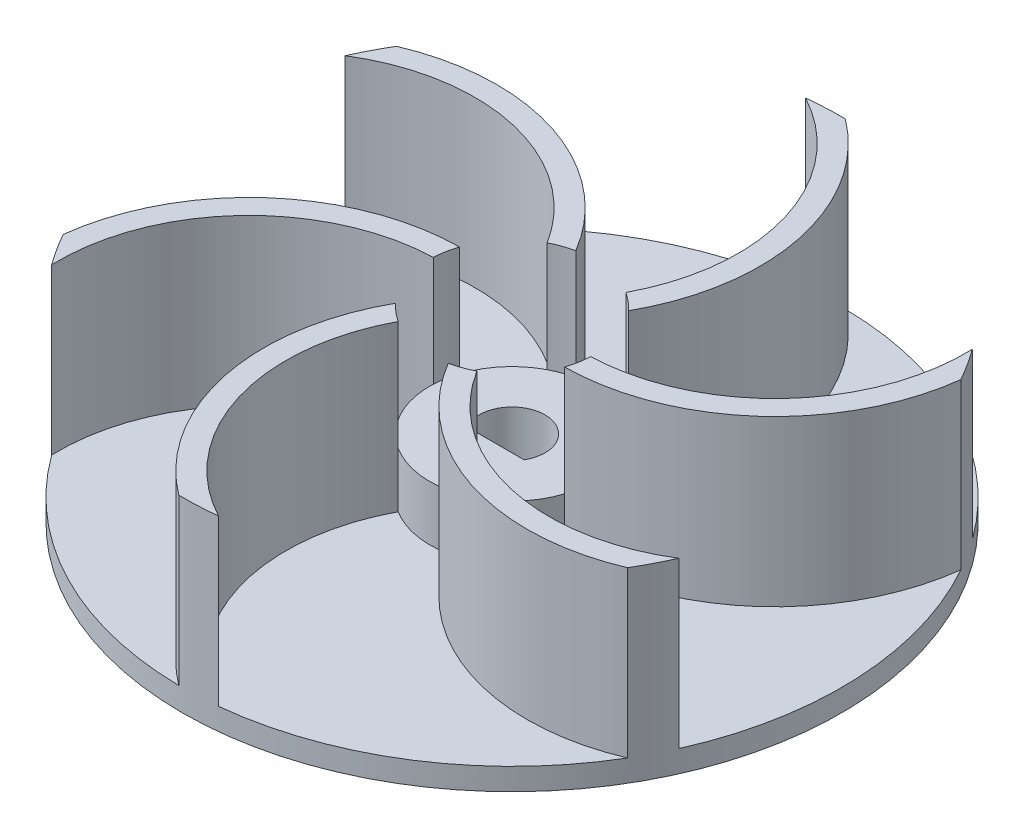
ISO-10303-21;
HEADER;
FILE_DESCRIPTION(('STEP AP214'),'2;1');
FILE_NAME('part.step','',(''),(''),'','','');
FILE_SCHEMA(('AUTOMOTIVE_DESIGN { 1 0 10303 214 1 1 1 1 }'));
ENDSEC;
DATA;
#1=APPLICATION_CONTEXT('core data for automotive mechanical design processes');
#2=APPLICATION_PROTOCOL_DEFINITION('international standard','automotive_design',2000,#1);
#3=PRODUCT_CONTEXT('',#1,'mechanical');
#4=PRODUCT('Part','Part','',(#3));
#5=PRODUCT_RELATED_PRODUCT_CATEGORY('part','',(#4));
#6=PRODUCT_DEFINITION_FORMATION('','',#4);
#7=PRODUCT_DEFINITION_CONTEXT('part definition',#1,'design');
#8=PRODUCT_DEFINITION('design','',#6,#7);
#9=PRODUCT_DEFINITION_SHAPE('','',#8);
#10=(LENGTH_UNIT() NAMED_UNIT(*) SI_UNIT(.MILLI.,.METRE.));
#11=(NAMED_UNIT(*) PLANE_ANGLE_UNIT() SI_UNIT($,.RADIAN.));
#12=(NAMED_UNIT(*) SI_UNIT($,.STERADIAN.) SOLID_ANGLE_UNIT());
#13=UNCERTAINTY_MEASURE_WITH_UNIT(LENGTH_MEASURE(1.E-05),#10,'distance_accuracy_value','');
#14=(GEOMETRIC_REPRESENTATION_CONTEXT(3) GLOBAL_UNCERTAINTY_ASSIGNED_CONTEXT((#13)) GLOBAL_UNIT_ASSIGNED_CONTEXT((#10,
#11,#12)) REPRESENTATION_CONTEXT('',''));
#15=CARTESIAN_POINT('',(0.,0.,0.));
#16=DIRECTION('',(0.,0.,1.));
#17=DIRECTION('',(1.,0.,0.));
#18=AXIS2_PLACEMENT_3D('',#15,#16,#17);
#19=CARTESIAN_POINT('',(0.,2.,0.));
#20=DIRECTION('',(0.,1.,0.));
#21=DIRECTION('',(0.,0.,1.));
#22=AXIS2_PLACEMENT_3D('',#19,#20,#21);
#23=PLANE('',#22);
#24=CARTESIAN_POINT('',(0.,2.,0.));
#25=DIRECTION('',(0.,1.,0.));
#26=DIRECTION('',(0.,0.,1.));
#27=AXIS2_PLACEMENT_3D('',#24,#25,#26);
#28=CIRCLE('',#27,30.);
#29=CARTESIAN_POINT('',(24.2798449504015,2.,-17.6207017222488));
#30=VERTEX_POINT('',#29);
#31=CARTESIAN_POINT('',(0.336728620153093,2.,-29.9981101710819));
#32=VERTEX_POINT('',#31);
#33=EDGE_CURVE('E69',#30,#32,#28,.T.);
#34=ORIENTED_EDGE('',*,*,#33,.T.);
#35=CARTESIAN_POINT('',(-11.3148710896796,2.,-14.4982185058663));
#36=DIRECTION('',(0.,1.,0.));
#37=DIRECTION('',(-0.866025403784433,0.,0.50000000000001));
#38=AXIS2_PLACEMENT_3D('',#35,#36,#37);
#39=CIRCLE('',#38,19.3908849058416);
#40=CARTESIAN_POINT('',(5.59034887781454,2.,-4.99979993842931));
#41=VERTEX_POINT('',#40);
#42=EDGE_CURVE('E283',#41,#32,#39,.T.);
#43=ORIENTED_EDGE('',*,*,#42,.F.);
#44=CARTESIAN_POINT('',(0.,2.,0.));
#45=DIRECTION('',(0.,1.,0.));
#46=DIRECTION('',(0.,0.,1.));
#47=AXIS2_PLACEMENT_3D('',#44,#45,#46);
#48=CIRCLE('',#47,7.5);
#49=CARTESIAN_POINT('',(7.49261908807197,2.,0.332654777599112));
#50=VERTEX_POINT('',#49);
#51=EDGE_CURVE('E509',#41,#50,#48,.F.);
#52=ORIENTED_EDGE('',*,*,#51,.T.);
#53=CARTESIAN_POINT('',(6.89838999085812,2.,-17.0480750571418));
#54=DIRECTION('',(0.,1.,0.));
#55=DIRECTION('',(-0.866025403784443,0.,-0.499999999999992));
#56=AXIS2_PLACEMENT_3D('',#53,#54,#55);
#57=CIRCLE('',#56,17.3908849058416);
#58=EDGE_CURVE('E266',#50,#30,#57,.T.);
#59=ORIENTED_EDGE('',*,*,#58,.T.);
#60=EDGE_LOOP('',(#34,#43,#52,#59));
#61=FACE_BOUND('',#60,.T.);
#62=ADVANCED_FACE('F45',(#61),#23,.T.);
#63=CARTESIAN_POINT('',(0.,7.,0.));
#64=DIRECTION('',(0.,-1.,0.));
#65=DIRECTION('',(0.,0.,-1.));
#66=AXIS2_PLACEMENT_3D('',#63,#64,#65);
#67=CYLINDRICAL_SURFACE('',#66,7.5);
#68=DIRECTION('',(0.,-1.,0.));
#69=VECTOR('',#68,1.);
#70=CARTESIAN_POINT('',(5.59034887781454,9.5,-4.99979993842931));
#71=LINE('',#70,#69);
#72=CARTESIAN_POINT('',(5.59034887781454,7.,-4.99979993842931));
#73=VERTEX_POINT('',#72);
#74=EDGE_CURVE('E54',#73,#41,#71,.T.);
#75=ORIENTED_EDGE('',*,*,#74,.F.);
#76=CARTESIAN_POINT('',(0.,7.,0.));
#77=DIRECTION('',(0.,1.,0.));
#78=DIRECTION('',(0.,0.,1.));
#79=AXIS2_PLACEMENT_3D('',#76,#77,#78);
#80=CIRCLE('',#79,7.5);
#81=CARTESIAN_POINT('',(7.49261908807197,7.,0.332654777599115));
#82=VERTEX_POINT('',#81);
#83=EDGE_CURVE('E565',#82,#73,#80,.T.);
#84=ORIENTED_EDGE('',*,*,#83,.F.);
#85=DIRECTION('',(0.,-1.,0.));
#86=VECTOR('',#85,1.);
#87=CARTESIAN_POINT('',(7.49261908807197,9.5,0.332654777599112));
#88=LINE('',#87,#86);
#89=EDGE_CURVE('E554',#82,#50,#88,.T.);
#90=ORIENTED_EDGE('',*,*,#89,.T.);
#91=ORIENTED_EDGE('',*,*,#51,.F.);
#92=EDGE_LOOP('',(#75,#84,#90,#91));
#93=FACE_BOUND('',#92,.T.);
#94=ADVANCED_FACE('F564',(#93),#67,.T.);
#95=CARTESIAN_POINT('',(27.3998977991763,2.,12.2166116658709));
#96=VERTEX_POINT('',#95);
#97=CARTESIAN_POINT('',(26.1474897837579,2.,-14.7074395463071));
#98=VERTEX_POINT('',#97);
#99=EDGE_CURVE('E665',#96,#98,#28,.T.);
#100=ORIENTED_EDGE('',*,*,#99,.T.);
#101=CARTESIAN_POINT('',(6.89838999085812,2.,-17.0480750571418));
#102=DIRECTION('',(0.,1.,0.));
#103=DIRECTION('',(-0.866025403784443,0.,-0.499999999999992));
#104=AXIS2_PLACEMENT_3D('',#101,#102,#103);
#105=CIRCLE('',#104,19.3908849058416);
#106=CARTESIAN_POINT('',(7.12512819942692,2.,2.34148417499058));
#107=VERTEX_POINT('',#106);
#108=EDGE_CURVE('E308',#107,#98,#105,.T.);
#109=ORIENTED_EDGE('',*,*,#108,.F.);
#110=CARTESIAN_POINT('',(3.45822205594483,2.,6.65512585995011));
#111=VERTEX_POINT('',#110);
#112=EDGE_CURVE('E743',#107,#111,#48,.F.);
#113=ORIENTED_EDGE('',*,*,#112,.T.);
#114=CARTESIAN_POINT('',(18.2132610805377,2.,-2.5498565512753));
#115=DIRECTION('',(0.,1.,0.));
#116=DIRECTION('',(0.,0.,-1.));
#117=AXIS2_PLACEMENT_3D('',#114,#115,#116);
#118=CIRCLE('',#117,17.3908849058416);
#119=EDGE_CURVE('E338',#111,#96,#118,.T.);
#120=ORIENTED_EDGE('',*,*,#119,.T.);
#121=EDGE_LOOP('',(#100,#109,#113,#120));
#122=FACE_BOUND('',#121,.T.);
#123=ADVANCED_FACE('F686',(#122),#23,.T.);
#124=DIRECTION('',(0.,-1.,0.));
#125=VECTOR('',#124,1.);
#126=CARTESIAN_POINT('',(7.12512819942692,9.5,2.34148417499058));
#127=LINE('',#126,#125);
#128=CARTESIAN_POINT('',(7.12512819942692,7.,2.34148417499058));
#129=VERTEX_POINT('',#128);
#130=EDGE_CURVE('E550',#129,#107,#127,.T.);
#131=ORIENTED_EDGE('',*,*,#130,.F.);
#132=CARTESIAN_POINT('',(3.45822205594483,7.,6.65512585995011));
#133=VERTEX_POINT('',#132);
#134=EDGE_CURVE('E643',#133,#129,#80,.T.);
#135=ORIENTED_EDGE('',*,*,#134,.F.);
#136=DIRECTION('',(0.,-1.,0.));
#137=VECTOR('',#136,1.);
#138=CARTESIAN_POINT('',(3.45822205594483,9.5,6.65512585995011));
#139=LINE('',#138,#137);
#140=EDGE_CURVE('E546',#133,#111,#139,.T.);
#141=ORIENTED_EDGE('',*,*,#140,.T.);
#142=ORIENTED_EDGE('',*,*,#112,.F.);
#143=EDGE_LOOP('',(#131,#135,#141,#142));
#144=FACE_BOUND('',#143,.T.);
#145=ADVANCED_FACE('F691',(#144),#67,.T.);
#146=CARTESIAN_POINT('',(3.12005284877472,2.,29.8373133881195));
#147=VERTEX_POINT('',#146);
#148=CARTESIAN_POINT('',(25.8107611636046,2.,15.2906706247751));
#149=VERTEX_POINT('',#148);
#150=EDGE_CURVE('E668',#147,#149,#28,.T.);
#151=ORIENTED_EDGE('',*,*,#150,.T.);
#152=CARTESIAN_POINT('',(18.2132610805377,2.,-2.5498565512753));
#153=DIRECTION('',(0.,1.,0.));
#154=DIRECTION('',(0.,0.,-1.));
#155=AXIS2_PLACEMENT_3D('',#152,#153,#154);
#156=CIRCLE('',#155,19.3908849058416);
#157=CARTESIAN_POINT('',(1.5347793216123,2.,7.34128411341989));
#158=VERTEX_POINT('',#157);
#159=EDGE_CURVE('E344',#158,#149,#156,.T.);
#160=ORIENTED_EDGE('',*,*,#159,.F.);
#161=CARTESIAN_POINT('',(-4.03439703212711,2.,6.32247108235095));
#162=VERTEX_POINT('',#161);
#163=EDGE_CURVE('E746',#158,#162,#48,.F.);
#164=ORIENTED_EDGE('',*,*,#163,.T.);
#165=CARTESIAN_POINT('',(11.3148710896795,2.,14.4982185058664));
#166=DIRECTION('',(0.,1.,0.));
#167=DIRECTION('',(0.866025403784436,0.,-0.500000000000004));
#168=AXIS2_PLACEMENT_3D('',#165,#166,#167);
#169=CIRCLE('',#168,17.3908849058416);
#170=EDGE_CURVE('E374',#162,#147,#169,.T.);
#171=ORIENTED_EDGE('',*,*,#170,.T.);
#172=EDGE_LOOP('',(#151,#160,#164,#171));
#173=FACE_BOUND('',#172,.T.);
#174=ADVANCED_FACE('F694',(#173),#23,.T.);
#175=DIRECTION('',(0.,-1.,0.));
#176=VECTOR('',#175,1.);
#177=CARTESIAN_POINT('',(1.5347793216123,9.5,7.34128411341989));
#178=LINE('',#177,#176);
#179=CARTESIAN_POINT('',(1.5347793216123,7.,7.34128411341989));
#180=VERTEX_POINT('',#179);
#181=EDGE_CURVE('E542',#180,#158,#178,.T.);
#182=ORIENTED_EDGE('',*,*,#181,.F.);
#183=CARTESIAN_POINT('',(-4.03439703212711,7.,6.32247108235095));
#184=VERTEX_POINT('',#183);
#185=EDGE_CURVE('E635',#184,#180,#80,.T.);
#186=ORIENTED_EDGE('',*,*,#185,.F.);
#187=DIRECTION('',(0.,-1.,0.));
#188=VECTOR('',#187,1.);
#189=CARTESIAN_POINT('',(-4.03439703212711,9.5,6.32247108235095));
#190=LINE('',#189,#188);
#191=EDGE_CURVE('E538',#184,#162,#190,.T.);
#192=ORIENTED_EDGE('',*,*,#191,.T.);
#193=ORIENTED_EDGE('',*,*,#163,.F.);
#194=EDGE_LOOP('',(#182,#186,#192,#193));
#195=FACE_BOUND('',#194,.T.);
#196=ADVANCED_FACE('F709',(#195),#67,.T.);
#197=CARTESIAN_POINT('',(-24.2798449504017,2.,17.6207017222486));
#198=VERTEX_POINT('',#197);
#199=CARTESIAN_POINT('',(-0.336728620153303,2.,29.9981101710819));
#200=VERTEX_POINT('',#199);
#201=EDGE_CURVE('E514',#198,#200,#28,.T.);
#202=ORIENTED_EDGE('',*,*,#201,.T.);
#203=CARTESIAN_POINT('',(11.3148710896795,2.,14.4982185058664));
#204=DIRECTION('',(0.,1.,0.));
#205=DIRECTION('',(0.866025403784436,0.,-0.500000000000004));
#206=AXIS2_PLACEMENT_3D('',#203,#204,#205);
#207=CIRCLE('',#206,19.3908849058416);
#208=CARTESIAN_POINT('',(-5.59034887781457,2.,4.99979993842927));
#209=VERTEX_POINT('',#208);
#210=EDGE_CURVE('E380',#209,#200,#207,.T.);
#211=ORIENTED_EDGE('',*,*,#210,.F.);
#212=CARTESIAN_POINT('',(-7.49261908807197,2.,-0.332654777599167));
#213=VERTEX_POINT('',#212);
#214=EDGE_CURVE('E749',#209,#213,#48,.F.);
#215=ORIENTED_EDGE('',*,*,#214,.T.);
#216=CARTESIAN_POINT('',(-6.89838999085824,2.,17.0480750571417));
#217=DIRECTION('',(0.,1.,0.));
#218=DIRECTION('',(0.86602540378444,0.,0.499999999999998));
#219=AXIS2_PLACEMENT_3D('',#216,#217,#218);
#220=CIRCLE('',#219,17.3908849058416);
#221=EDGE_CURVE('E410',#213,#198,#220,.T.);
#222=ORIENTED_EDGE('',*,*,#221,.T.);
#223=EDGE_LOOP('',(#202,#211,#215,#222));
#224=FACE_BOUND('',#223,.T.);
#225=ADVANCED_FACE('F702',(#224),#23,.T.);
#226=DIRECTION('',(0.,-1.,0.));
#227=VECTOR('',#226,1.);
#228=CARTESIAN_POINT('',(-5.59034887781457,9.5,4.99979993842927));
#229=LINE('',#228,#227);
#230=CARTESIAN_POINT('',(-5.59034887781457,7.,4.99979993842927));
#231=VERTEX_POINT('',#230);
#232=EDGE_CURVE('E534',#231,#209,#229,.T.);
#233=ORIENTED_EDGE('',*,*,#232,.F.);
#234=CARTESIAN_POINT('',(-7.49261908807197,7.,-0.332654777599167));
#235=VERTEX_POINT('',#234);
#236=EDGE_CURVE('E629',#235,#231,#80,.T.);
#237=ORIENTED_EDGE('',*,*,#236,.F.);
#238=DIRECTION('',(0.,-1.,0.));
#239=VECTOR('',#238,1.);
#240=CARTESIAN_POINT('',(-7.49261908807197,9.5,-0.332654777599167));
#241=LINE('',#240,#239);
#242=EDGE_CURVE('E530',#235,#213,#241,.T.);
#243=ORIENTED_EDGE('',*,*,#242,.T.);
#244=ORIENTED_EDGE('',*,*,#214,.F.);
#245=EDGE_LOOP('',(#233,#237,#243,#244));
#246=FACE_BOUND('',#245,.T.);
#247=ADVANCED_FACE('F701',(#246),#67,.T.);
#248=CARTESIAN_POINT('',(-27.3998977991763,2.,-12.2166116658709));
#249=VERTEX_POINT('',#248);
#250=CARTESIAN_POINT('',(-26.147489783758,2.,14.7074395463069));
#251=VERTEX_POINT('',#250);
#252=EDGE_CURVE('E510',#249,#251,#28,.T.);
#253=ORIENTED_EDGE('',*,*,#252,.T.);
#254=CARTESIAN_POINT('',(-6.89838999085824,2.,17.0480750571417));
#255=DIRECTION('',(0.,1.,0.));
#256=DIRECTION('',(0.86602540378444,0.,0.499999999999998));
#257=AXIS2_PLACEMENT_3D('',#254,#255,#256);
#258=CIRCLE('',#257,19.3908849058416);
#259=CARTESIAN_POINT('',(-7.1251281994269,2.,-2.34148417499063));
#260=VERTEX_POINT('',#259);
#261=EDGE_CURVE('E416',#260,#251,#258,.T.);
#262=ORIENTED_EDGE('',*,*,#261,.F.);
#263=CARTESIAN_POINT('',(-3.45822205594483,2.,-6.65512585995011));
#264=VERTEX_POINT('',#263);
#265=EDGE_CURVE('E503',#260,#264,#48,.F.);
#266=ORIENTED_EDGE('',*,*,#265,.T.);
#267=CARTESIAN_POINT('',(-18.2132610805377,2.,2.5498565512753));
#268=DIRECTION('',(0.,1.,0.));
#269=DIRECTION('',(0.,0.,1.));
#270=AXIS2_PLACEMENT_3D('',#267,#268,#269);
#271=CIRCLE('',#270,17.3908849058416);
#272=EDGE_CURVE('E461',#264,#249,#271,.T.);
#273=ORIENTED_EDGE('',*,*,#272,.T.);
#274=EDGE_LOOP('',(#253,#262,#266,#273));
#275=FACE_BOUND('',#274,.T.);
#276=ADVANCED_FACE('F608',(#275),#23,.T.);
#277=DIRECTION('',(0.,-1.,0.));
#278=VECTOR('',#277,1.);
#279=CARTESIAN_POINT('',(-7.1251281994269,9.5,-2.34148417499063));
#280=LINE('',#279,#278);
#281=CARTESIAN_POINT('',(-7.1251281994269,7.,-2.34148417499063));
#282=VERTEX_POINT('',#281);
#283=EDGE_CURVE('E526',#282,#260,#280,.T.);
#284=ORIENTED_EDGE('',*,*,#283,.F.);
#285=CARTESIAN_POINT('',(-3.45822205594483,7.,-6.65512585995011));
#286=VERTEX_POINT('',#285);
#287=EDGE_CURVE('E504',#286,#282,#80,.T.);
#288=ORIENTED_EDGE('',*,*,#287,.F.);
#289=DIRECTION('',(0.,-1.,0.));
#290=VECTOR('',#289,1.);
#291=CARTESIAN_POINT('',(-3.45822205594483,17.,-6.65512585995011));
#292=LINE('',#291,#290);
#293=EDGE_CURVE('E494',#286,#264,#292,.T.);
#294=ORIENTED_EDGE('',*,*,#293,.T.);
#295=ORIENTED_EDGE('',*,*,#265,.F.);
#296=EDGE_LOOP('',(#284,#288,#294,#295));
#297=FACE_BOUND('',#296,.T.);
#298=ADVANCED_FACE('F600',(#297),#67,.T.);
#299=CARTESIAN_POINT('',(0.,0.,0.));
#300=DIRECTION('',(0.,1.,0.));
#301=DIRECTION('',(0.,0.,1.));
#302=AXIS2_PLACEMENT_3D('',#299,#300,#301);
#303=PLANE('',#302);
#304=CARTESIAN_POINT('',(0.,0.,0.));
#305=DIRECTION('',(0.,1.,0.));
#306=DIRECTION('',(0.,0.,1.));
#307=AXIS2_PLACEMENT_3D('',#304,#305,#306);
#308=CIRCLE('',#307,30.);
#309=CARTESIAN_POINT('',(0.,0.,30.));
#310=VERTEX_POINT('',#309);
#311=EDGE_CURVE('E508',#310,#310,#308,.T.);
#312=ORIENTED_EDGE('',*,*,#311,.F.);
#313=EDGE_LOOP('',(#312));
#314=FACE_BOUND('',#313,.T.);
#315=CARTESIAN_POINT('',(0.,0.,0.));
#316=DIRECTION('',(0.,1.,0.));
#317=DIRECTION('',(0.,0.,1.));
#318=AXIS2_PLACEMENT_3D('',#315,#316,#317);
#319=CIRCLE('',#318,3.);
#320=CARTESIAN_POINT('',(2.59807621135332,0.,1.5));
#321=VERTEX_POINT('',#320);
#322=CARTESIAN_POINT('',(-2.59807621135332,0.,1.5));
#323=VERTEX_POINT('',#322);
#324=EDGE_CURVE('E446',#321,#323,#319,.T.);
#325=ORIENTED_EDGE('',*,*,#324,.T.);
#326=DIRECTION('',(1.,0.,0.));
#327=VECTOR('',#326,1.);
#328=CARTESIAN_POINT('',(-2.59807621135332,0.,1.5));
#329=LINE('',#328,#327);
#330=EDGE_CURVE('E450',#323,#321,#329,.T.);
#331=ORIENTED_EDGE('',*,*,#330,.T.);
#332=EDGE_LOOP('',(#325,#331));
#333=FACE_BOUND('',#332,.T.);
#334=ADVANCED_FACE('F707',(#314,#333),#303,.F.);
#335=CARTESIAN_POINT('',(0.,7.,0.));
#336=DIRECTION('',(0.,1.,0.));
#337=DIRECTION('',(0.,0.,1.));
#338=AXIS2_PLACEMENT_3D('',#335,#336,#337);
#339=PLANE('',#338);
#340=CARTESIAN_POINT('',(-1.5347793216123,7.,-7.34128411341989));
#341=VERTEX_POINT('',#340);
#342=EDGE_CURVE('E499',#341,#286,#80,.T.);
#343=ORIENTED_EDGE('',*,*,#342,.T.);
#344=ORIENTED_EDGE('',*,*,#287,.T.);
#345=EDGE_CURVE('E622',#282,#235,#80,.T.);
#346=ORIENTED_EDGE('',*,*,#345,.T.);
#347=ORIENTED_EDGE('',*,*,#236,.T.);
#348=EDGE_CURVE('E631',#231,#184,#80,.T.);
#349=ORIENTED_EDGE('',*,*,#348,.T.);
#350=ORIENTED_EDGE('',*,*,#185,.T.);
#351=EDGE_CURVE('E639',#180,#133,#80,.T.);
#352=ORIENTED_EDGE('',*,*,#351,.T.);
#353=ORIENTED_EDGE('',*,*,#134,.T.);
#354=EDGE_CURVE('E574',#129,#82,#80,.T.);
#355=ORIENTED_EDGE('',*,*,#354,.T.);
#356=ORIENTED_EDGE('',*,*,#83,.T.);
#357=CARTESIAN_POINT('',(4.03439703212707,7.,-6.32247108235097));
#358=VERTEX_POINT('',#357);
#359=EDGE_CURVE('E571',#73,#358,#80,.T.);
#360=ORIENTED_EDGE('',*,*,#359,.T.);
#361=EDGE_CURVE('E498',#358,#341,#80,.T.);
#362=ORIENTED_EDGE('',*,*,#361,.T.);
#363=EDGE_LOOP('',(#343,#344,#346,#347,#349,#350,#352,#353,#355,#356,#360,#362));
#364=FACE_BOUND('',#363,.T.);
#365=DIRECTION('',(-1.,0.,0.));
#366=VECTOR('',#365,1.);
#367=CARTESIAN_POINT('',(0.,7.,1.5));
#368=LINE('',#367,#366);
#369=CARTESIAN_POINT('',(2.59807621135332,7.,1.5));
#370=VERTEX_POINT('',#369);
#371=CARTESIAN_POINT('',(-2.59807621135332,7.,1.5));
#372=VERTEX_POINT('',#371);
#373=EDGE_CURVE('E513',#370,#372,#368,.T.);
#374=ORIENTED_EDGE('',*,*,#373,.T.);
#375=CARTESIAN_POINT('',(0.,7.,0.));
#376=DIRECTION('',(0.,1.,0.));
#377=DIRECTION('',(0.,0.,1.));
#378=AXIS2_PLACEMENT_3D('',#375,#376,#377);
#379=CIRCLE('',#378,3.);
#380=EDGE_CURVE('E522',#372,#370,#379,.F.);
#381=ORIENTED_EDGE('',*,*,#380,.T.);
#382=EDGE_LOOP('',(#374,#381));
#383=FACE_BOUND('',#382,.T.);
#384=ADVANCED_FACE('F569',(#364,#383),#339,.T.);
#385=CARTESIAN_POINT('',(0.,2.,0.));
#386=DIRECTION('',(0.,-1.,0.));
#387=DIRECTION('',(0.,0.,-1.));
#388=AXIS2_PLACEMENT_3D('',#385,#386,#387);
#389=CYLINDRICAL_SURFACE('',#388,30.);
#390=ORIENTED_EDGE('',*,*,#252,.F.);
#391=DIRECTION('',(0.,-1.,0.));
#392=VECTOR('',#391,1.);
#393=CARTESIAN_POINT('',(-27.3998977991763,17.,-12.2166116658709));
#394=LINE('',#393,#392);
#395=CARTESIAN_POINT('',(-27.3998977991763,17.,-12.2166116658709));
#396=VERTEX_POINT('',#395);
#397=EDGE_CURVE('E476',#396,#249,#394,.T.);
#398=ORIENTED_EDGE('',*,*,#397,.F.);
#399=CARTESIAN_POINT('',(0.,17.,0.));
#400=DIRECTION('',(0.,1.,0.));
#401=DIRECTION('',(0.,0.,1.));
#402=AXIS2_PLACEMENT_3D('',#399,#400,#401);
#403=CIRCLE('',#402,30.);
#404=CARTESIAN_POINT('',(-25.8107611636046,17.,-15.2906706247751));
#405=VERTEX_POINT('',#404);
#406=EDGE_CURVE('E473',#405,#396,#403,.T.);
#407=ORIENTED_EDGE('',*,*,#406,.F.);
#408=DIRECTION('',(0.,-1.,0.));
#409=VECTOR('',#408,1.);
#410=CARTESIAN_POINT('',(-25.8107611636046,17.,-15.2906706247751));
#411=LINE('',#410,#409);
#412=CARTESIAN_POINT('',(-25.8107611636046,2.,-15.2906706247751));
#413=VERTEX_POINT('',#412);
#414=EDGE_CURVE('E485',#405,#413,#411,.T.);
#415=ORIENTED_EDGE('',*,*,#414,.T.);
#416=CARTESIAN_POINT('',(-3.12005284877493,2.,-29.8373133881194));
#417=VERTEX_POINT('',#416);
#418=EDGE_CURVE('E515',#417,#413,#28,.T.);
#419=ORIENTED_EDGE('',*,*,#418,.F.);
#420=DIRECTION('',(0.,-1.,0.));
#421=VECTOR('',#420,1.);
#422=CARTESIAN_POINT('',(-3.12005284877493,17.,-29.8373133881194));
#423=LINE('',#422,#421);
#424=CARTESIAN_POINT('',(-3.12005284877493,17.,-29.8373133881194));
#425=VERTEX_POINT('',#424);
#426=EDGE_CURVE('E292',#425,#417,#423,.T.);
#427=ORIENTED_EDGE('',*,*,#426,.F.);
#428=CARTESIAN_POINT('',(0.,17.,0.));
#429=DIRECTION('',(0.,1.,0.));
#430=DIRECTION('',(-0.866025403784433,0.,0.50000000000001));
#431=AXIS2_PLACEMENT_3D('',#428,#429,#430);
#432=CIRCLE('',#431,30.);
#433=CARTESIAN_POINT('',(0.336728620153093,17.,-29.9981101710819));
#434=VERTEX_POINT('',#433);
#435=EDGE_CURVE('E280',#434,#425,#432,.T.);
#436=ORIENTED_EDGE('',*,*,#435,.F.);
#437=DIRECTION('',(0.,-1.,0.));
#438=VECTOR('',#437,1.);
#439=CARTESIAN_POINT('',(0.336728620153093,17.,-29.9981101710819));
#440=LINE('',#439,#438);
#441=EDGE_CURVE('E297',#434,#32,#440,.T.);
#442=ORIENTED_EDGE('',*,*,#441,.T.);
#443=ORIENTED_EDGE('',*,*,#33,.F.);
#444=DIRECTION('',(0.,-1.,0.));
#445=VECTOR('',#444,1.);
#446=CARTESIAN_POINT('',(24.2798449504015,17.,-17.6207017222488));
#447=LINE('',#446,#445);
#448=CARTESIAN_POINT('',(24.2798449504015,17.,-17.6207017222488));
#449=VERTEX_POINT('',#448);
#450=EDGE_CURVE('E317',#449,#30,#447,.T.);
#451=ORIENTED_EDGE('',*,*,#450,.F.);
#452=CARTESIAN_POINT('',(0.,17.,0.));
#453=DIRECTION('',(0.,1.,0.));
#454=DIRECTION('',(-0.866025403784443,0.,-0.499999999999992));
#455=AXIS2_PLACEMENT_3D('',#452,#453,#454);
#456=CIRCLE('',#455,30.);
#457=CARTESIAN_POINT('',(26.1474897837579,17.,-14.7074395463071));
#458=VERTEX_POINT('',#457);
#459=EDGE_CURVE('E314',#458,#449,#456,.T.);
#460=ORIENTED_EDGE('',*,*,#459,.F.);
#461=DIRECTION('',(0.,-1.,0.));
#462=VECTOR('',#461,1.);
#463=CARTESIAN_POINT('',(26.1474897837579,17.,-14.7074395463071));
#464=LINE('',#463,#462);
#465=EDGE_CURVE('E326',#458,#98,#464,.T.);
#466=ORIENTED_EDGE('',*,*,#465,.T.);
#467=ORIENTED_EDGE('',*,*,#99,.F.);
#468=DIRECTION('',(0.,-1.,0.));
#469=VECTOR('',#468,1.);
#470=CARTESIAN_POINT('',(27.3998977991763,17.,12.2166116658709));
#471=LINE('',#470,#469);
#472=CARTESIAN_POINT('',(27.3998977991763,17.,12.2166116658709));
#473=VERTEX_POINT('',#472);
#474=EDGE_CURVE('E353',#473,#96,#471,.T.);
#475=ORIENTED_EDGE('',*,*,#474,.F.);
#476=CARTESIAN_POINT('',(0.,17.,0.));
#477=DIRECTION('',(0.,1.,0.));
#478=DIRECTION('',(0.,0.,-1.));
#479=AXIS2_PLACEMENT_3D('',#476,#477,#478);
#480=CIRCLE('',#479,30.);
#481=CARTESIAN_POINT('',(25.8107611636046,17.,15.2906706247751));
#482=VERTEX_POINT('',#481);
#483=EDGE_CURVE('E350',#482,#473,#480,.T.);
#484=ORIENTED_EDGE('',*,*,#483,.F.);
#485=DIRECTION('',(0.,-1.,0.));
#486=VECTOR('',#485,1.);
#487=CARTESIAN_POINT('',(25.8107611636046,17.,15.2906706247751));
#488=LINE('',#487,#486);
#489=EDGE_CURVE('E362',#482,#149,#488,.T.);
#490=ORIENTED_EDGE('',*,*,#489,.T.);
#491=ORIENTED_EDGE('',*,*,#150,.F.);
#492=DIRECTION('',(0.,-1.,0.));
#493=VECTOR('',#492,1.);
#494=CARTESIAN_POINT('',(3.12005284877472,17.,29.8373133881195));
#495=LINE('',#494,#493);
#496=CARTESIAN_POINT('',(3.12005284877472,17.,29.8373133881195));
#497=VERTEX_POINT('',#496);
#498=EDGE_CURVE('E389',#497,#147,#495,.T.);
#499=ORIENTED_EDGE('',*,*,#498,.F.);
#500=CARTESIAN_POINT('',(0.,17.,0.));
#501=DIRECTION('',(0.,1.,0.));
#502=DIRECTION('',(0.866025403784436,0.,-0.500000000000004));
#503=AXIS2_PLACEMENT_3D('',#500,#501,#502);
#504=CIRCLE('',#503,30.);
#505=CARTESIAN_POINT('',(-0.336728620153303,17.,29.9981101710819));
#506=VERTEX_POINT('',#505);
#507=EDGE_CURVE('E386',#506,#497,#504,.T.);
#508=ORIENTED_EDGE('',*,*,#507,.F.);
#509=DIRECTION('',(0.,-1.,0.));
#510=VECTOR('',#509,1.);
#511=CARTESIAN_POINT('',(-0.336728620153303,17.,29.9981101710819));
#512=LINE('',#511,#510);
#513=EDGE_CURVE('E398',#506,#200,#512,.T.);
#514=ORIENTED_EDGE('',*,*,#513,.T.);
#515=ORIENTED_EDGE('',*,*,#201,.F.);
#516=DIRECTION('',(0.,-1.,0.));
#517=VECTOR('',#516,1.);
#518=CARTESIAN_POINT('',(-24.2798449504017,17.,17.6207017222486));
#519=LINE('',#518,#517);
#520=CARTESIAN_POINT('',(-24.2798449504017,17.,17.6207017222486));
#521=VERTEX_POINT('',#520);
#522=EDGE_CURVE('E425',#521,#198,#519,.T.);
#523=ORIENTED_EDGE('',*,*,#522,.F.);
#524=CARTESIAN_POINT('',(0.,17.,0.));
#525=DIRECTION('',(0.,1.,0.));
#526=DIRECTION('',(0.86602540378444,0.,0.499999999999998));
#527=AXIS2_PLACEMENT_3D('',#524,#525,#526);
#528=CIRCLE('',#527,30.);
#529=CARTESIAN_POINT('',(-26.147489783758,17.,14.7074395463069));
#530=VERTEX_POINT('',#529);
#531=EDGE_CURVE('E422',#530,#521,#528,.T.);
#532=ORIENTED_EDGE('',*,*,#531,.F.);
#533=DIRECTION('',(0.,-1.,0.));
#534=VECTOR('',#533,1.);
#535=CARTESIAN_POINT('',(-26.147489783758,17.,14.7074395463069));
#536=LINE('',#535,#534);
#537=EDGE_CURVE('E434',#530,#251,#536,.T.);
#538=ORIENTED_EDGE('',*,*,#537,.T.);
#539=EDGE_LOOP('',(#390,#398,#407,#415,#419,#427,#436,#442,#443,#451,#460,#466,#467,#475,#484,
#490,#491,#499,#508,#514,#515,#523,#532,#538));
#540=FACE_BOUND('',#539,.T.);
#541=ORIENTED_EDGE('',*,*,#311,.T.);
#542=EDGE_LOOP('',(#541));
#543=FACE_BOUND('',#542,.T.);
#544=ADVANCED_FACE('F47',(#540,#543),#389,.T.);
#545=CARTESIAN_POINT('',(-11.3148710896796,2.,-14.4982185058663));
#546=DIRECTION('',(0.,1.,0.));
#547=DIRECTION('',(-0.866025403784433,0.,0.50000000000001));
#548=AXIS2_PLACEMENT_3D('',#545,#546,#547);
#549=CIRCLE('',#548,17.3908849058416);
#550=CARTESIAN_POINT('',(4.03439703212707,2.,-6.32247108235097));
#551=VERTEX_POINT('',#550);
#552=EDGE_CURVE('E61',#551,#417,#549,.T.);
#553=ORIENTED_EDGE('',*,*,#552,.T.);
#554=ORIENTED_EDGE('',*,*,#418,.T.);
#555=CARTESIAN_POINT('',(-18.2132610805377,2.,2.5498565512753));
#556=DIRECTION('',(0.,1.,0.));
#557=DIRECTION('',(0.,0.,1.));
#558=AXIS2_PLACEMENT_3D('',#555,#556,#557);
#559=CIRCLE('',#558,19.3908849058416);
#560=CARTESIAN_POINT('',(-1.5347793216123,2.,-7.34128411341989));
#561=VERTEX_POINT('',#560);
#562=EDGE_CURVE('E467',#561,#413,#559,.T.);
#563=ORIENTED_EDGE('',*,*,#562,.F.);
#564=EDGE_CURVE('E505',#561,#551,#48,.F.);
#565=ORIENTED_EDGE('',*,*,#564,.T.);
#566=EDGE_LOOP('',(#553,#554,#563,#565));
#567=FACE_BOUND('',#566,.T.);
#568=ADVANCED_FACE('F669',(#567),#23,.T.);
#569=ORIENTED_EDGE('',*,*,#361,.F.);
#570=DIRECTION('',(0.,-1.,0.));
#571=VECTOR('',#570,1.);
#572=CARTESIAN_POINT('',(4.03439703212707,9.5,-6.32247108235097));
#573=LINE('',#572,#571);
#574=EDGE_CURVE('E11',#358,#551,#573,.T.);
#575=ORIENTED_EDGE('',*,*,#574,.T.);
#576=ORIENTED_EDGE('',*,*,#564,.F.);
#577=DIRECTION('',(0.,-1.,0.));
#578=VECTOR('',#577,1.);
#579=CARTESIAN_POINT('',(-1.5347793216123,17.,-7.34128411341989));
#580=LINE('',#579,#578);
#581=EDGE_CURVE('E489',#341,#561,#580,.T.);
#582=ORIENTED_EDGE('',*,*,#581,.F.);
#583=EDGE_LOOP('',(#569,#575,#576,#582));
#584=FACE_BOUND('',#583,.T.);
#585=ADVANCED_FACE('F594',(#584),#67,.T.);
#586=CARTESIAN_POINT('',(-18.2132610805377,17.,2.5498565512753));
#587=DIRECTION('',(0.,-1.,0.));
#588=DIRECTION('',(0.,0.,-1.));
#589=AXIS2_PLACEMENT_3D('',#586,#587,#588);
#590=CYLINDRICAL_SURFACE('',#589,17.3908849058416);
#591=ORIENTED_EDGE('',*,*,#272,.F.);
#592=ORIENTED_EDGE('',*,*,#293,.F.);
#593=CARTESIAN_POINT('',(-3.45822205594483,17.,-6.65512585995011));
#594=VERTEX_POINT('',#593);
#595=EDGE_CURVE('E495',#594,#286,#292,.T.);
#596=ORIENTED_EDGE('',*,*,#595,.F.);
#597=CARTESIAN_POINT('',(-18.2132610805377,17.,2.5498565512753));
#598=DIRECTION('',(0.,1.,0.));
#599=DIRECTION('',(0.,0.,1.));
#600=AXIS2_PLACEMENT_3D('',#597,#598,#599);
#601=CIRCLE('',#600,17.3908849058416);
#602=EDGE_CURVE('E462',#594,#396,#601,.T.);
#603=ORIENTED_EDGE('',*,*,#602,.T.);
#604=ORIENTED_EDGE('',*,*,#397,.T.);
#605=EDGE_LOOP('',(#591,#592,#596,#603,#604));
#606=FACE_BOUND('',#605,.T.);
#607=ADVANCED_FACE('F604',(#606),#590,.F.);
#608=CARTESIAN_POINT('',(0.,17.,0.));
#609=DIRECTION('',(0.,-1.,0.));
#610=DIRECTION('',(0.,0.,-1.));
#611=AXIS2_PLACEMENT_3D('',#608,#609,#610);
#612=CYLINDRICAL_SURFACE('',#611,7.5);
#613=ORIENTED_EDGE('',*,*,#342,.F.);
#614=CARTESIAN_POINT('',(-1.5347793216123,17.,-7.34128411341989));
#615=VERTEX_POINT('',#614);
#616=EDGE_CURVE('E490',#615,#341,#580,.T.);
#617=ORIENTED_EDGE('',*,*,#616,.F.);
#618=CARTESIAN_POINT('',(0.,17.,0.));
#619=DIRECTION('',(0.,1.,0.));
#620=DIRECTION('',(0.,0.,1.));
#621=AXIS2_PLACEMENT_3D('',#618,#619,#620);
#622=CIRCLE('',#621,7.5);
#623=EDGE_CURVE('E466',#594,#615,#622,.F.);
#624=ORIENTED_EDGE('',*,*,#623,.F.);
#625=ORIENTED_EDGE('',*,*,#595,.T.);
#626=EDGE_LOOP('',(#613,#617,#624,#625));
#627=FACE_BOUND('',#626,.T.);
#628=ADVANCED_FACE('F585',(#627),#612,.F.);
#629=CARTESIAN_POINT('',(-18.2132610805377,17.,2.5498565512753));
#630=DIRECTION('',(0.,-1.,0.));
#631=DIRECTION('',(0.,0.,-1.));
#632=AXIS2_PLACEMENT_3D('',#629,#630,#631);
#633=CYLINDRICAL_SURFACE('',#632,19.3908849058416);
#634=ORIENTED_EDGE('',*,*,#562,.T.);
#635=ORIENTED_EDGE('',*,*,#414,.F.);
#636=CARTESIAN_POINT('',(-18.2132610805377,17.,2.5498565512753));
#637=DIRECTION('',(0.,1.,0.));
#638=DIRECTION('',(0.,0.,1.));
#639=AXIS2_PLACEMENT_3D('',#636,#637,#638);
#640=CIRCLE('',#639,19.3908849058416);
#641=EDGE_CURVE('E470',#615,#405,#640,.T.);
#642=ORIENTED_EDGE('',*,*,#641,.F.);
#643=ORIENTED_EDGE('',*,*,#616,.T.);
#644=ORIENTED_EDGE('',*,*,#581,.T.);
#645=EDGE_LOOP('',(#634,#635,#642,#643,#644));
#646=FACE_BOUND('',#645,.T.);
#647=ADVANCED_FACE('F590',(#646),#633,.T.);
#648=CARTESIAN_POINT('',(0.,17.,0.));
#649=DIRECTION('',(0.,1.,0.));
#650=DIRECTION('',(0.,0.,1.));
#651=AXIS2_PLACEMENT_3D('',#648,#649,#650);
#652=PLANE('',#651);
#653=ORIENTED_EDGE('',*,*,#602,.F.);
#654=ORIENTED_EDGE('',*,*,#623,.T.);
#655=ORIENTED_EDGE('',*,*,#641,.T.);
#656=ORIENTED_EDGE('',*,*,#406,.T.);
#657=EDGE_LOOP('',(#653,#654,#655,#656));
#658=FACE_BOUND('',#657,.T.);
#659=ADVANCED_FACE('F672',(#658),#652,.T.);
#660=CARTESIAN_POINT('',(0.,17.,0.));
#661=DIRECTION('',(0.,-1.,0.));
#662=DIRECTION('',(0.,0.,-1.));
#663=AXIS2_PLACEMENT_3D('',#660,#661,#662);
#664=CYLINDRICAL_SURFACE('',#663,3.);
#665=DIRECTION('',(0.,-1.,0.));
#666=VECTOR('',#665,1.);
#667=CARTESIAN_POINT('',(-2.59807621135332,17.,1.5));
#668=LINE('',#667,#666);
#669=EDGE_CURVE('E458',#372,#323,#668,.T.);
#670=ORIENTED_EDGE('',*,*,#669,.T.);
#671=ORIENTED_EDGE('',*,*,#324,.F.);
#672=DIRECTION('',(0.,-1.,0.));
#673=VECTOR('',#672,1.);
#674=CARTESIAN_POINT('',(2.59807621135332,17.,1.5));
#675=LINE('',#674,#673);
#676=EDGE_CURVE('E454',#370,#321,#675,.T.);
#677=ORIENTED_EDGE('',*,*,#676,.F.);
#678=ORIENTED_EDGE('',*,*,#380,.F.);
#679=EDGE_LOOP('',(#670,#671,#677,#678));
#680=FACE_BOUND('',#679,.T.);
#681=ADVANCED_FACE('F674',(#680),#664,.F.);
#682=CARTESIAN_POINT('',(-2.59807621135332,17.,1.5));
#683=DIRECTION('',(0.,0.,-1.));
#684=DIRECTION('',(-1.,0.,0.));
#685=AXIS2_PLACEMENT_3D('',#682,#683,#684);
#686=PLANE('',#685);
#687=ORIENTED_EDGE('',*,*,#676,.T.);
#688=ORIENTED_EDGE('',*,*,#330,.F.);
#689=ORIENTED_EDGE('',*,*,#669,.F.);
#690=ORIENTED_EDGE('',*,*,#373,.F.);
#691=EDGE_LOOP('',(#687,#688,#689,#690));
#692=FACE_BOUND('',#691,.T.);
#693=ADVANCED_FACE('F680',(#692),#686,.T.);
#694=CARTESIAN_POINT('',(-6.89838999085824,17.,17.0480750571417));
#695=DIRECTION('',(0.,-1.,0.));
#696=DIRECTION('',(0.,0.,-1.));
#697=AXIS2_PLACEMENT_3D('',#694,#695,#696);
#698=CYLINDRICAL_SURFACE('',#697,17.3908849058416);
#699=ORIENTED_EDGE('',*,*,#221,.F.);
#700=ORIENTED_EDGE('',*,*,#242,.F.);
#701=DIRECTION('',(0.,-1.,0.));
#702=VECTOR('',#701,1.);
#703=CARTESIAN_POINT('',(-7.49261908807197,17.,-0.332654777599167));
#704=LINE('',#703,#702);
#705=CARTESIAN_POINT('',(-7.49261908807197,17.,-0.332654777599167));
#706=VERTEX_POINT('',#705);
#707=EDGE_CURVE('E442',#706,#235,#704,.T.);
#708=ORIENTED_EDGE('',*,*,#707,.F.);
#709=CARTESIAN_POINT('',(-6.89838999085824,17.,17.0480750571417));
#710=DIRECTION('',(0.,1.,0.));
#711=DIRECTION('',(0.86602540378444,0.,0.499999999999998));
#712=AXIS2_PLACEMENT_3D('',#709,#710,#711);
#713=CIRCLE('',#712,17.3908849058416);
#714=EDGE_CURVE('E411',#706,#521,#713,.T.);
#715=ORIENTED_EDGE('',*,*,#714,.T.);
#716=ORIENTED_EDGE('',*,*,#522,.T.);
#717=EDGE_LOOP('',(#699,#700,#708,#715,#716));
#718=FACE_BOUND('',#717,.T.);
#719=ADVANCED_FACE('F756',(#718),#698,.F.);
#720=CARTESIAN_POINT('',(0.,17.,0.));
#721=DIRECTION('',(0.,-1.,0.));
#722=DIRECTION('',(0.,0.,-1.));
#723=AXIS2_PLACEMENT_3D('',#720,#721,#722);
#724=CYLINDRICAL_SURFACE('',#723,7.5);
#725=ORIENTED_EDGE('',*,*,#345,.F.);
#726=DIRECTION('',(0.,-1.,0.));
#727=VECTOR('',#726,1.);
#728=CARTESIAN_POINT('',(-7.1251281994269,17.,-2.34148417499063));
#729=LINE('',#728,#727);
#730=CARTESIAN_POINT('',(-7.1251281994269,17.,-2.34148417499063));
#731=VERTEX_POINT('',#730);
#732=EDGE_CURVE('E438',#731,#282,#729,.T.);
#733=ORIENTED_EDGE('',*,*,#732,.F.);
#734=CARTESIAN_POINT('',(0.,17.,0.));
#735=DIRECTION('',(0.,1.,0.));
#736=DIRECTION('',(0.86602540378444,0.,0.499999999999998));
#737=AXIS2_PLACEMENT_3D('',#734,#735,#736);
#738=CIRCLE('',#737,7.5);
#739=EDGE_CURVE('E415',#706,#731,#738,.F.);
#740=ORIENTED_EDGE('',*,*,#739,.F.);
#741=ORIENTED_EDGE('',*,*,#707,.T.);
#742=EDGE_LOOP('',(#725,#733,#740,#741));
#743=FACE_BOUND('',#742,.T.);
#744=ADVANCED_FACE('F626',(#743),#724,.F.);
#745=CARTESIAN_POINT('',(-6.89838999085824,17.,17.0480750571417));
#746=DIRECTION('',(0.,-1.,0.));
#747=DIRECTION('',(0.,0.,-1.));
#748=AXIS2_PLACEMENT_3D('',#745,#746,#747);
#749=CYLINDRICAL_SURFACE('',#748,19.3908849058416);
#750=ORIENTED_EDGE('',*,*,#261,.T.);
#751=ORIENTED_EDGE('',*,*,#537,.F.);
#752=CARTESIAN_POINT('',(-6.89838999085824,17.,17.0480750571417));
#753=DIRECTION('',(0.,1.,0.));
#754=DIRECTION('',(0.86602540378444,0.,0.499999999999998));
#755=AXIS2_PLACEMENT_3D('',#752,#753,#754);
#756=CIRCLE('',#755,19.3908849058416);
#757=EDGE_CURVE('E419',#731,#530,#756,.T.);
#758=ORIENTED_EDGE('',*,*,#757,.F.);
#759=ORIENTED_EDGE('',*,*,#732,.T.);
#760=ORIENTED_EDGE('',*,*,#283,.T.);
#761=EDGE_LOOP('',(#750,#751,#758,#759,#760));
#762=FACE_BOUND('',#761,.T.);
#763=ADVANCED_FACE('F617',(#762),#749,.T.);
#764=CARTESIAN_POINT('',(0.,17.,0.));
#765=DIRECTION('',(0.,1.,0.));
#766=DIRECTION('',(0.86602540378444,0.,0.499999999999998));
#767=AXIS2_PLACEMENT_3D('',#764,#765,#766);
#768=PLANE('',#767);
#769=ORIENTED_EDGE('',*,*,#714,.F.);
#770=ORIENTED_EDGE('',*,*,#739,.T.);
#771=ORIENTED_EDGE('',*,*,#757,.T.);
#772=ORIENTED_EDGE('',*,*,#531,.T.);
#773=EDGE_LOOP('',(#769,#770,#771,#772));
#774=FACE_BOUND('',#773,.T.);
#775=ADVANCED_FACE('F787',(#774),#768,.T.);
#776=CARTESIAN_POINT('',(11.3148710896795,17.,14.4982185058664));
#777=DIRECTION('',(0.,-1.,0.));
#778=DIRECTION('',(0.,0.,-1.));
#779=AXIS2_PLACEMENT_3D('',#776,#777,#778);
#780=CYLINDRICAL_SURFACE('',#779,17.3908849058416);
#781=ORIENTED_EDGE('',*,*,#170,.F.);
#782=ORIENTED_EDGE('',*,*,#191,.F.);
#783=DIRECTION('',(0.,-1.,0.));
#784=VECTOR('',#783,1.);
#785=CARTESIAN_POINT('',(-4.03439703212711,17.,6.32247108235095));
#786=LINE('',#785,#784);
#787=CARTESIAN_POINT('',(-4.03439703212711,17.,6.32247108235095));
#788=VERTEX_POINT('',#787);
#789=EDGE_CURVE('E406',#788,#184,#786,.T.);
#790=ORIENTED_EDGE('',*,*,#789,.F.);
#791=CARTESIAN_POINT('',(11.3148710896795,17.,14.4982185058664));
#792=DIRECTION('',(0.,1.,0.));
#793=DIRECTION('',(0.866025403784436,0.,-0.500000000000004));
#794=AXIS2_PLACEMENT_3D('',#791,#792,#793);
#795=CIRCLE('',#794,17.3908849058416);
#796=EDGE_CURVE('E375',#788,#497,#795,.T.);
#797=ORIENTED_EDGE('',*,*,#796,.T.);
#798=ORIENTED_EDGE('',*,*,#498,.T.);
#799=EDGE_LOOP('',(#781,#782,#790,#797,#798));
#800=FACE_BOUND('',#799,.T.);
#801=ADVANCED_FACE('F770',(#800),#780,.F.);
#802=CARTESIAN_POINT('',(0.,17.,0.));
#803=DIRECTION('',(0.,-1.,0.));
#804=DIRECTION('',(0.,0.,-1.));
#805=AXIS2_PLACEMENT_3D('',#802,#803,#804);
#806=CYLINDRICAL_SURFACE('',#805,7.5);
#807=ORIENTED_EDGE('',*,*,#348,.F.);
#808=DIRECTION('',(0.,-1.,0.));
#809=VECTOR('',#808,1.);
#810=CARTESIAN_POINT('',(-5.59034887781457,17.,4.99979993842927));
#811=LINE('',#810,#809);
#812=CARTESIAN_POINT('',(-5.59034887781457,17.,4.99979993842927));
#813=VERTEX_POINT('',#812);
#814=EDGE_CURVE('E402',#813,#231,#811,.T.);
#815=ORIENTED_EDGE('',*,*,#814,.F.);
#816=CARTESIAN_POINT('',(0.,17.,0.));
#817=DIRECTION('',(0.,1.,0.));
#818=DIRECTION('',(0.866025403784436,0.,-0.500000000000004));
#819=AXIS2_PLACEMENT_3D('',#816,#817,#818);
#820=CIRCLE('',#819,7.5);
#821=EDGE_CURVE('E379',#788,#813,#820,.F.);
#822=ORIENTED_EDGE('',*,*,#821,.F.);
#823=ORIENTED_EDGE('',*,*,#789,.T.);
#824=EDGE_LOOP('',(#807,#815,#822,#823));
#825=FACE_BOUND('',#824,.T.);
#826=ADVANCED_FACE('F767',(#825),#806,.F.);
#827=CARTESIAN_POINT('',(11.3148710896795,17.,14.4982185058664));
#828=DIRECTION('',(0.,-1.,0.));
#829=DIRECTION('',(0.,0.,-1.));
#830=AXIS2_PLACEMENT_3D('',#827,#828,#829);
#831=CYLINDRICAL_SURFACE('',#830,19.3908849058416);
#832=ORIENTED_EDGE('',*,*,#210,.T.);
#833=ORIENTED_EDGE('',*,*,#513,.F.);
#834=CARTESIAN_POINT('',(11.3148710896795,17.,14.4982185058664));
#835=DIRECTION('',(0.,1.,0.));
#836=DIRECTION('',(0.866025403784436,0.,-0.500000000000004));
#837=AXIS2_PLACEMENT_3D('',#834,#835,#836);
#838=CIRCLE('',#837,19.3908849058416);
#839=EDGE_CURVE('E383',#813,#506,#838,.T.);
#840=ORIENTED_EDGE('',*,*,#839,.F.);
#841=ORIENTED_EDGE('',*,*,#814,.T.);
#842=ORIENTED_EDGE('',*,*,#232,.T.);
#843=EDGE_LOOP('',(#832,#833,#840,#841,#842));
#844=FACE_BOUND('',#843,.T.);
#845=ADVANCED_FACE('F762',(#844),#831,.T.);
#846=CARTESIAN_POINT('',(0.,17.,0.));
#847=DIRECTION('',(0.,1.,0.));
#848=DIRECTION('',(0.866025403784436,0.,-0.500000000000004));
#849=AXIS2_PLACEMENT_3D('',#846,#847,#848);
#850=PLANE('',#849);
#851=ORIENTED_EDGE('',*,*,#796,.F.);
#852=ORIENTED_EDGE('',*,*,#821,.T.);
#853=ORIENTED_EDGE('',*,*,#839,.T.);
#854=ORIENTED_EDGE('',*,*,#507,.T.);
#855=EDGE_LOOP('',(#851,#852,#853,#854));
#856=FACE_BOUND('',#855,.T.);
#857=ADVANCED_FACE('F772',(#856),#850,.T.);
#858=CARTESIAN_POINT('',(18.2132610805377,17.,-2.5498565512753));
#859=DIRECTION('',(0.,-1.,0.));
#860=DIRECTION('',(0.,0.,-1.));
#861=AXIS2_PLACEMENT_3D('',#858,#859,#860);
#862=CYLINDRICAL_SURFACE('',#861,17.3908849058416);
#863=ORIENTED_EDGE('',*,*,#119,.F.);
#864=ORIENTED_EDGE('',*,*,#140,.F.);
#865=DIRECTION('',(0.,-1.,0.));
#866=VECTOR('',#865,1.);
#867=CARTESIAN_POINT('',(3.45822205594483,17.,6.65512585995011));
#868=LINE('',#867,#866);
#869=CARTESIAN_POINT('',(3.45822205594483,17.,6.65512585995011));
#870=VERTEX_POINT('',#869);
#871=EDGE_CURVE('E370',#870,#133,#868,.T.);
#872=ORIENTED_EDGE('',*,*,#871,.F.);
#873=CARTESIAN_POINT('',(18.2132610805377,17.,-2.5498565512753));
#874=DIRECTION('',(0.,1.,0.));
#875=DIRECTION('',(0.,0.,-1.));
#876=AXIS2_PLACEMENT_3D('',#873,#874,#875);
#877=CIRCLE('',#876,17.3908849058416);
#878=EDGE_CURVE('E339',#870,#473,#877,.T.);
#879=ORIENTED_EDGE('',*,*,#878,.T.);
#880=ORIENTED_EDGE('',*,*,#474,.T.);
#881=EDGE_LOOP('',(#863,#864,#872,#879,#880));
#882=FACE_BOUND('',#881,.T.);
#883=ADVANCED_FACE('F742',(#882),#862,.F.);
#884=CARTESIAN_POINT('',(0.,17.,0.));
#885=DIRECTION('',(0.,-1.,0.));
#886=DIRECTION('',(0.,0.,-1.));
#887=AXIS2_PLACEMENT_3D('',#884,#885,#886);
#888=CYLINDRICAL_SURFACE('',#887,7.5);
#889=ORIENTED_EDGE('',*,*,#351,.F.);
#890=DIRECTION('',(0.,-1.,0.));
#891=VECTOR('',#890,1.);
#892=CARTESIAN_POINT('',(1.5347793216123,17.,7.34128411341989));
#893=LINE('',#892,#891);
#894=CARTESIAN_POINT('',(1.5347793216123,17.,7.34128411341989));
#895=VERTEX_POINT('',#894);
#896=EDGE_CURVE('E366',#895,#180,#893,.T.);
#897=ORIENTED_EDGE('',*,*,#896,.F.);
#898=CARTESIAN_POINT('',(0.,17.,0.));
#899=DIRECTION('',(0.,1.,0.));
#900=DIRECTION('',(0.,0.,-1.));
#901=AXIS2_PLACEMENT_3D('',#898,#899,#900);
#902=CIRCLE('',#901,7.5);
#903=EDGE_CURVE('E343',#870,#895,#902,.F.);
#904=ORIENTED_EDGE('',*,*,#903,.F.);
#905=ORIENTED_EDGE('',*,*,#871,.T.);
#906=EDGE_LOOP('',(#889,#897,#904,#905));
#907=FACE_BOUND('',#906,.T.);
#908=ADVANCED_FACE('F739',(#907),#888,.F.);
#909=CARTESIAN_POINT('',(18.2132610805377,17.,-2.5498565512753));
#910=DIRECTION('',(0.,-1.,0.));
#911=DIRECTION('',(0.,0.,-1.));
#912=AXIS2_PLACEMENT_3D('',#909,#910,#911);
#913=CYLINDRICAL_SURFACE('',#912,19.3908849058416);
#914=ORIENTED_EDGE('',*,*,#159,.T.);
#915=ORIENTED_EDGE('',*,*,#489,.F.);
#916=CARTESIAN_POINT('',(18.2132610805377,17.,-2.5498565512753));
#917=DIRECTION('',(0.,1.,0.));
#918=DIRECTION('',(0.,0.,-1.));
#919=AXIS2_PLACEMENT_3D('',#916,#917,#918);
#920=CIRCLE('',#919,19.3908849058416);
#921=EDGE_CURVE('E347',#895,#482,#920,.T.);
#922=ORIENTED_EDGE('',*,*,#921,.F.);
#923=ORIENTED_EDGE('',*,*,#896,.T.);
#924=ORIENTED_EDGE('',*,*,#181,.T.);
#925=EDGE_LOOP('',(#914,#915,#922,#923,#924));
#926=FACE_BOUND('',#925,.T.);
#927=ADVANCED_FACE('F728',(#926),#913,.T.);
#928=CARTESIAN_POINT('',(0.,17.,0.));
#929=DIRECTION('',(0.,1.,0.));
#930=DIRECTION('',(0.,0.,-1.));
#931=AXIS2_PLACEMENT_3D('',#928,#929,#930);
#932=PLANE('',#931);
#933=ORIENTED_EDGE('',*,*,#878,.F.);
#934=ORIENTED_EDGE('',*,*,#903,.T.);
#935=ORIENTED_EDGE('',*,*,#921,.T.);
#936=ORIENTED_EDGE('',*,*,#483,.T.);
#937=EDGE_LOOP('',(#933,#934,#935,#936));
#938=FACE_BOUND('',#937,.T.);
#939=ADVANCED_FACE('F735',(#938),#932,.T.);
#940=CARTESIAN_POINT('',(6.89838999085812,17.,-17.0480750571418));
#941=DIRECTION('',(0.,-1.,0.));
#942=DIRECTION('',(0.,0.,-1.));
#943=AXIS2_PLACEMENT_3D('',#940,#941,#942);
#944=CYLINDRICAL_SURFACE('',#943,17.3908849058416);
#945=ORIENTED_EDGE('',*,*,#58,.F.);
#946=ORIENTED_EDGE('',*,*,#89,.F.);
#947=DIRECTION('',(0.,-1.,0.));
#948=VECTOR('',#947,1.);
#949=CARTESIAN_POINT('',(7.49261908807197,17.,0.332654777599115));
#950=LINE('',#949,#948);
#951=CARTESIAN_POINT('',(7.49261908807197,17.,0.332654777599115));
#952=VERTEX_POINT('',#951);
#953=EDGE_CURVE('E334',#952,#82,#950,.T.);
#954=ORIENTED_EDGE('',*,*,#953,.F.);
#955=CARTESIAN_POINT('',(6.89838999085812,17.,-17.0480750571418));
#956=DIRECTION('',(0.,1.,0.));
#957=DIRECTION('',(-0.866025403784443,0.,-0.499999999999992));
#958=AXIS2_PLACEMENT_3D('',#955,#956,#957);
#959=CIRCLE('',#958,17.3908849058416);
#960=EDGE_CURVE('E303',#952,#449,#959,.T.);
#961=ORIENTED_EDGE('',*,*,#960,.T.);
#962=ORIENTED_EDGE('',*,*,#450,.T.);
#963=EDGE_LOOP('',(#945,#946,#954,#961,#962));
#964=FACE_BOUND('',#963,.T.);
#965=ADVANCED_FACE('F663',(#964),#944,.F.);
#966=CARTESIAN_POINT('',(0.,17.,0.));
#967=DIRECTION('',(0.,-1.,0.));
#968=DIRECTION('',(0.,0.,-1.));
#969=AXIS2_PLACEMENT_3D('',#966,#967,#968);
#970=CYLINDRICAL_SURFACE('',#969,7.5);
#971=ORIENTED_EDGE('',*,*,#354,.F.);
#972=DIRECTION('',(0.,-1.,0.));
#973=VECTOR('',#972,1.);
#974=CARTESIAN_POINT('',(7.12512819942692,17.,2.34148417499058));
#975=LINE('',#974,#973);
#976=CARTESIAN_POINT('',(7.12512819942692,17.,2.34148417499058));
#977=VERTEX_POINT('',#976);
#978=EDGE_CURVE('E330',#977,#129,#975,.T.);
#979=ORIENTED_EDGE('',*,*,#978,.F.);
#980=CARTESIAN_POINT('',(0.,17.,0.));
#981=DIRECTION('',(0.,1.,0.));
#982=DIRECTION('',(-0.866025403784443,0.,-0.499999999999992));
#983=AXIS2_PLACEMENT_3D('',#980,#981,#982);
#984=CIRCLE('',#983,7.5);
#985=EDGE_CURVE('E307',#952,#977,#984,.F.);
#986=ORIENTED_EDGE('',*,*,#985,.F.);
#987=ORIENTED_EDGE('',*,*,#953,.T.);
#988=EDGE_LOOP('',(#971,#979,#986,#987));
#989=FACE_BOUND('',#988,.T.);
#990=ADVANCED_FACE('F650',(#989),#970,.F.);
#991=CARTESIAN_POINT('',(6.89838999085812,17.,-17.0480750571418));
#992=DIRECTION('',(0.,-1.,0.));
#993=DIRECTION('',(0.,0.,-1.));
#994=AXIS2_PLACEMENT_3D('',#991,#992,#993);
#995=CYLINDRICAL_SURFACE('',#994,19.3908849058416);
#996=ORIENTED_EDGE('',*,*,#108,.T.);
#997=ORIENTED_EDGE('',*,*,#465,.F.);
#998=CARTESIAN_POINT('',(6.89838999085812,17.,-17.0480750571418));
#999=DIRECTION('',(0.,1.,0.));
#1000=DIRECTION('',(-0.866025403784443,0.,-0.499999999999992));
#1001=AXIS2_PLACEMENT_3D('',#998,#999,#1000);
#1002=CIRCLE('',#1001,19.3908849058416);
#1003=EDGE_CURVE('E311',#977,#458,#1002,.T.);
#1004=ORIENTED_EDGE('',*,*,#1003,.F.);
#1005=ORIENTED_EDGE('',*,*,#978,.T.);
#1006=ORIENTED_EDGE('',*,*,#130,.T.);
#1007=EDGE_LOOP('',(#996,#997,#1004,#1005,#1006));
#1008=FACE_BOUND('',#1007,.T.);
#1009=ADVANCED_FACE('F654',(#1008),#995,.T.);
#1010=CARTESIAN_POINT('',(0.,17.,0.));
#1011=DIRECTION('',(0.,1.,0.));
#1012=DIRECTION('',(-0.866025403784443,0.,-0.499999999999992));
#1013=AXIS2_PLACEMENT_3D('',#1010,#1011,#1012);
#1014=PLANE('',#1013);
#1015=ORIENTED_EDGE('',*,*,#960,.F.);
#1016=ORIENTED_EDGE('',*,*,#985,.T.);
#1017=ORIENTED_EDGE('',*,*,#1003,.T.);
#1018=ORIENTED_EDGE('',*,*,#459,.T.);
#1019=EDGE_LOOP('',(#1015,#1016,#1017,#1018));
#1020=FACE_BOUND('',#1019,.T.);
#1021=ADVANCED_FACE('F659',(#1020),#1014,.T.);
#1022=CARTESIAN_POINT('',(-11.3148710896796,17.,-14.4982185058663));
#1023=DIRECTION('',(0.,-1.,0.));
#1024=DIRECTION('',(0.,0.,-1.));
#1025=AXIS2_PLACEMENT_3D('',#1022,#1023,#1024);
#1026=CYLINDRICAL_SURFACE('',#1025,17.3908849058416);
#1027=ORIENTED_EDGE('',*,*,#552,.F.);
#1028=ORIENTED_EDGE('',*,*,#574,.F.);
#1029=DIRECTION('',(0.,-1.,0.));
#1030=VECTOR('',#1029,1.);
#1031=CARTESIAN_POINT('',(4.03439703212707,17.,-6.32247108235097));
#1032=LINE('',#1031,#1030);
#1033=CARTESIAN_POINT('',(4.03439703212707,17.,-6.32247108235097));
#1034=VERTEX_POINT('',#1033);
#1035=EDGE_CURVE('E257',#1034,#358,#1032,.T.);
#1036=ORIENTED_EDGE('',*,*,#1035,.F.);
#1037=CARTESIAN_POINT('',(-11.3148710896796,17.,-14.4982185058663));
#1038=DIRECTION('',(0.,1.,0.));
#1039=DIRECTION('',(-0.866025403784433,0.,0.50000000000001));
#1040=AXIS2_PLACEMENT_3D('',#1037,#1038,#1039);
#1041=CIRCLE('',#1040,17.3908849058416);
#1042=EDGE_CURVE('E262',#1034,#425,#1041,.T.);
#1043=ORIENTED_EDGE('',*,*,#1042,.T.);
#1044=ORIENTED_EDGE('',*,*,#426,.T.);
#1045=EDGE_LOOP('',(#1027,#1028,#1036,#1043,#1044));
#1046=FACE_BOUND('',#1045,.T.);
#1047=ADVANCED_FACE('F259',(#1046),#1026,.F.);
#1048=CARTESIAN_POINT('',(0.,17.,0.));
#1049=DIRECTION('',(0.,-1.,0.));
#1050=DIRECTION('',(0.,0.,-1.));
#1051=AXIS2_PLACEMENT_3D('',#1048,#1049,#1050);
#1052=CYLINDRICAL_SURFACE('',#1051,7.5);
#1053=ORIENTED_EDGE('',*,*,#359,.F.);
#1054=DIRECTION('',(0.,-1.,0.));
#1055=VECTOR('',#1054,1.);
#1056=CARTESIAN_POINT('',(5.59034887781454,17.,-4.99979993842931));
#1057=LINE('',#1056,#1055);
#1058=CARTESIAN_POINT('',(5.59034887781454,17.,-4.99979993842931));
#1059=VERTEX_POINT('',#1058);
#1060=EDGE_CURVE('E267',#1059,#73,#1057,.T.);
#1061=ORIENTED_EDGE('',*,*,#1060,.F.);
#1062=CARTESIAN_POINT('',(0.,17.,0.));
#1063=DIRECTION('',(0.,1.,0.));
#1064=DIRECTION('',(-0.866025403784433,0.,0.50000000000001));
#1065=AXIS2_PLACEMENT_3D('',#1062,#1063,#1064);
#1066=CIRCLE('',#1065,7.5);
#1067=EDGE_CURVE('E270',#1034,#1059,#1066,.F.);
#1068=ORIENTED_EDGE('',*,*,#1067,.F.);
#1069=ORIENTED_EDGE('',*,*,#1035,.T.);
#1070=EDGE_LOOP('',(#1053,#1061,#1068,#1069));
#1071=FACE_BOUND('',#1070,.T.);
#1072=ADVANCED_FACE('F271',(#1071),#1052,.F.);
#1073=CARTESIAN_POINT('',(-11.3148710896796,17.,-14.4982185058663));
#1074=DIRECTION('',(0.,-1.,0.));
#1075=DIRECTION('',(0.,0.,-1.));
#1076=AXIS2_PLACEMENT_3D('',#1073,#1074,#1075);
#1077=CYLINDRICAL_SURFACE('',#1076,19.3908849058416);
#1078=ORIENTED_EDGE('',*,*,#42,.T.);
#1079=ORIENTED_EDGE('',*,*,#441,.F.);
#1080=CARTESIAN_POINT('',(-11.3148710896796,17.,-14.4982185058663));
#1081=DIRECTION('',(0.,1.,0.));
#1082=DIRECTION('',(-0.866025403784433,0.,0.50000000000001));
#1083=AXIS2_PLACEMENT_3D('',#1080,#1081,#1082);
#1084=CIRCLE('',#1083,19.3908849058416);
#1085=EDGE_CURVE('E276',#1059,#434,#1084,.T.);
#1086=ORIENTED_EDGE('',*,*,#1085,.F.);
#1087=ORIENTED_EDGE('',*,*,#1060,.T.);
#1088=ORIENTED_EDGE('',*,*,#74,.T.);
#1089=EDGE_LOOP('',(#1078,#1079,#1086,#1087,#1088));
#1090=FACE_BOUND('',#1089,.T.);
#1091=ADVANCED_FACE('F560',(#1090),#1077,.T.);
#1092=CARTESIAN_POINT('',(0.,17.,0.));
#1093=DIRECTION('',(0.,1.,0.));
#1094=DIRECTION('',(-0.866025403784433,0.,0.50000000000001));
#1095=AXIS2_PLACEMENT_3D('',#1092,#1093,#1094);
#1096=PLANE('',#1095);
#1097=ORIENTED_EDGE('',*,*,#1042,.F.);
#1098=ORIENTED_EDGE('',*,*,#1067,.T.);
#1099=ORIENTED_EDGE('',*,*,#1085,.T.);
#1100=ORIENTED_EDGE('',*,*,#435,.T.);
#1101=EDGE_LOOP('',(#1097,#1098,#1099,#1100));
#1102=FACE_BOUND('',#1101,.T.);
#1103=ADVANCED_FACE('F278',(#1102),#1096,.T.);
#1104=CLOSED_SHELL('',(#62,#94,#123,#145,#174,#196,#225,#247,#276,#298,#334,#384,#544,#568,#585,
#607,#628,#647,#659,#681,#693,#719,#744,#763,#775,#801,#826,#845,#857,#883,#908,#927,#939,#965,
#990,#1009,#1021,#1047,#1072,#1091,#1103));
#1105=MANIFOLD_SOLID_BREP('B2',#1104);
#1106=ADVANCED_BREP_SHAPE_REPRESENTATION('',(#18,#1105),#14);
#1107=SHAPE_DEFINITION_REPRESENTATION(#9,#1106);
ENDSEC;
END-ISO-10303-21;
